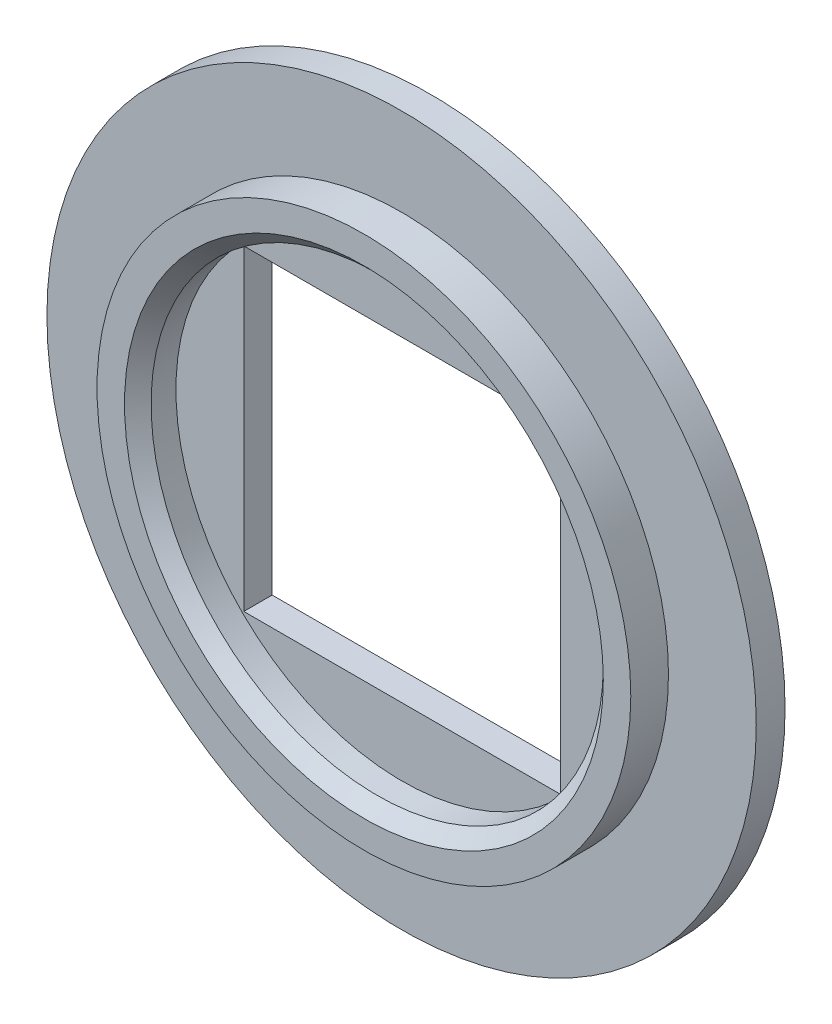
ISO-10303-21;
HEADER;
FILE_DESCRIPTION(('STEP AP214'),'2;1');
FILE_NAME('part.step','',(''),(''),'','','');
FILE_SCHEMA(('AUTOMOTIVE_DESIGN { 1 0 10303 214 1 1 1 1 }'));
ENDSEC;
DATA;
#1=APPLICATION_CONTEXT('core data for automotive mechanical design processes');
#2=APPLICATION_PROTOCOL_DEFINITION('international standard','automotive_design',2000,#1);
#3=PRODUCT_CONTEXT('',#1,'mechanical');
#4=PRODUCT('Part','Part','',(#3));
#5=PRODUCT_RELATED_PRODUCT_CATEGORY('part','',(#4));
#6=PRODUCT_DEFINITION_FORMATION('','',#4);
#7=PRODUCT_DEFINITION_CONTEXT('part definition',#1,'design');
#8=PRODUCT_DEFINITION('design','',#6,#7);
#9=PRODUCT_DEFINITION_SHAPE('','',#8);
#10=(LENGTH_UNIT() NAMED_UNIT(*) SI_UNIT(.MILLI.,.METRE.));
#11=(NAMED_UNIT(*) PLANE_ANGLE_UNIT() SI_UNIT($,.RADIAN.));
#12=(NAMED_UNIT(*) SI_UNIT($,.STERADIAN.) SOLID_ANGLE_UNIT());
#13=UNCERTAINTY_MEASURE_WITH_UNIT(LENGTH_MEASURE(1.E-05),#10,'distance_accuracy_value','');
#14=(GEOMETRIC_REPRESENTATION_CONTEXT(3) GLOBAL_UNCERTAINTY_ASSIGNED_CONTEXT((#13)) GLOBAL_UNIT_ASSIGNED_CONTEXT((#10,
#11,#12)) REPRESENTATION_CONTEXT('',''));
#15=CARTESIAN_POINT('',(0.,0.,0.));
#16=DIRECTION('',(0.,0.,1.));
#17=DIRECTION('',(1.,0.,0.));
#18=AXIS2_PLACEMENT_3D('',#15,#16,#17);
#19=CARTESIAN_POINT('',(0.,0.,0.));
#20=DIRECTION('',(0.,0.,1.));
#21=DIRECTION('',(1.,0.,0.));
#22=AXIS2_PLACEMENT_3D('',#19,#20,#21);
#23=PLANE('',#22);
#24=CARTESIAN_POINT('',(0.,0.,0.));
#25=DIRECTION('',(0.,0.,1.));
#26=DIRECTION('',(1.,0.,0.));
#27=AXIS2_PLACEMENT_3D('',#24,#25,#26);
#28=CIRCLE('',#27,8.);
#29=CARTESIAN_POINT('',(8.,0.,0.));
#30=VERTEX_POINT('',#29);
#31=EDGE_CURVE('E122',#30,#30,#28,.T.);
#32=ORIENTED_EDGE('',*,*,#31,.F.);
#33=EDGE_LOOP('',(#32));
#34=FACE_BOUND('',#33,.T.);
#35=DIRECTION('',(1.,0.,0.));
#36=VECTOR('',#35,1.);
#37=CARTESIAN_POINT('',(-3.57,-3.57,0.));
#38=LINE('',#37,#36);
#39=CARTESIAN_POINT('',(-3.57,-3.57,0.));
#40=VERTEX_POINT('',#39);
#41=CARTESIAN_POINT('',(3.57,-3.57,0.));
#42=VERTEX_POINT('',#41);
#43=EDGE_CURVE('E63',#40,#42,#38,.T.);
#44=ORIENTED_EDGE('',*,*,#43,.T.);
#45=DIRECTION('',(0.,1.,0.));
#46=VECTOR('',#45,1.);
#47=CARTESIAN_POINT('',(3.57,3.57,0.));
#48=LINE('',#47,#46);
#49=CARTESIAN_POINT('',(3.57,3.57,0.));
#50=VERTEX_POINT('',#49);
#51=EDGE_CURVE('E114',#42,#50,#48,.T.);
#52=ORIENTED_EDGE('',*,*,#51,.T.);
#53=DIRECTION('',(-1.,0.,0.));
#54=VECTOR('',#53,1.);
#55=CARTESIAN_POINT('',(-3.57,3.57,0.));
#56=LINE('',#55,#54);
#57=CARTESIAN_POINT('',(-3.57,3.57,0.));
#58=VERTEX_POINT('',#57);
#59=EDGE_CURVE('E92',#50,#58,#56,.T.);
#60=ORIENTED_EDGE('',*,*,#59,.T.);
#61=DIRECTION('',(0.,-1.,0.));
#62=VECTOR('',#61,1.);
#63=CARTESIAN_POINT('',(-3.57,0.,0.));
#64=LINE('',#63,#62);
#65=EDGE_CURVE('E88',#58,#40,#64,.T.);
#66=ORIENTED_EDGE('',*,*,#65,.T.);
#67=EDGE_LOOP('',(#44,#52,#60,#66));
#68=FACE_BOUND('',#67,.T.);
#69=ADVANCED_FACE('F39',(#34,#68),#23,.F.);
#70=CARTESIAN_POINT('',(0.,0.,0.65));
#71=DIRECTION('',(0.,0.,-1.));
#72=DIRECTION('',(-1.,0.,0.));
#73=AXIS2_PLACEMENT_3D('',#70,#71,#72);
#74=CYLINDRICAL_SURFACE('',#73,8.);
#75=CARTESIAN_POINT('',(0.,0.,0.65));
#76=DIRECTION('',(0.,0.,1.));
#77=DIRECTION('',(1.,0.,0.));
#78=AXIS2_PLACEMENT_3D('',#75,#76,#77);
#79=CIRCLE('',#78,8.);
#80=CARTESIAN_POINT('',(8.,0.,0.65));
#81=VERTEX_POINT('',#80);
#82=EDGE_CURVE('E125',#81,#81,#79,.T.);
#83=ORIENTED_EDGE('',*,*,#82,.F.);
#84=EDGE_LOOP('',(#83));
#85=FACE_BOUND('',#84,.T.);
#86=ORIENTED_EDGE('',*,*,#31,.T.);
#87=EDGE_LOOP('',(#86));
#88=FACE_BOUND('',#87,.T.);
#89=ADVANCED_FACE('F143',(#85,#88),#74,.T.);
#90=CARTESIAN_POINT('',(0.,0.,0.65));
#91=DIRECTION('',(0.,0.,1.));
#92=DIRECTION('',(1.,0.,0.));
#93=AXIS2_PLACEMENT_3D('',#90,#91,#92);
#94=PLANE('',#93);
#95=CARTESIAN_POINT('',(0.,0.,0.65));
#96=DIRECTION('',(0.,0.,1.));
#97=DIRECTION('',(1.,0.,0.));
#98=AXIS2_PLACEMENT_3D('',#95,#96,#97);
#99=CIRCLE('',#98,6.02);
#100=CARTESIAN_POINT('',(6.02,0.,0.65));
#101=VERTEX_POINT('',#100);
#102=EDGE_CURVE('E118',#101,#101,#99,.T.);
#103=ORIENTED_EDGE('',*,*,#102,.F.);
#104=EDGE_LOOP('',(#103));
#105=FACE_BOUND('',#104,.T.);
#106=ORIENTED_EDGE('',*,*,#82,.T.);
#107=EDGE_LOOP('',(#106));
#108=FACE_BOUND('',#107,.T.);
#109=ADVANCED_FACE('F149',(#105,#108),#94,.T.);
#110=CARTESIAN_POINT('',(0.,0.,1.5));
#111=DIRECTION('',(0.,0.,1.));
#112=DIRECTION('',(1.,0.,0.));
#113=AXIS2_PLACEMENT_3D('',#110,#111,#112);
#114=PLANE('',#113);
#115=CARTESIAN_POINT('',(0.,0.,1.5));
#116=DIRECTION('',(0.,0.,1.));
#117=DIRECTION('',(1.,0.,0.));
#118=AXIS2_PLACEMENT_3D('',#115,#116,#117);
#119=CIRCLE('',#118,5.40000000000001);
#120=CARTESIAN_POINT('',(5.40000000000001,0.,1.5));
#121=VERTEX_POINT('',#120);
#122=EDGE_CURVE('E11',#121,#121,#119,.F.);
#123=ORIENTED_EDGE('',*,*,#122,.T.);
#124=EDGE_LOOP('',(#123));
#125=FACE_BOUND('',#124,.T.);
#126=CARTESIAN_POINT('',(0.,0.,1.5));
#127=DIRECTION('',(0.,0.,1.));
#128=DIRECTION('',(1.,0.,0.));
#129=AXIS2_PLACEMENT_3D('',#126,#127,#128);
#130=CIRCLE('',#129,6.02);
#131=CARTESIAN_POINT('',(6.02,0.,1.5));
#132=VERTEX_POINT('',#131);
#133=EDGE_CURVE('E119',#132,#132,#130,.T.);
#134=ORIENTED_EDGE('',*,*,#133,.T.);
#135=EDGE_LOOP('',(#134));
#136=FACE_BOUND('',#135,.T.);
#137=ADVANCED_FACE('F156',(#125,#136),#114,.T.);
#138=CARTESIAN_POINT('',(0.,0.,1.5));
#139=DIRECTION('',(0.,0.,-1.));
#140=DIRECTION('',(-1.,0.,0.));
#141=AXIS2_PLACEMENT_3D('',#138,#139,#140);
#142=CYLINDRICAL_SURFACE('',#141,6.02);
#143=ORIENTED_EDGE('',*,*,#133,.F.);
#144=EDGE_LOOP('',(#143));
#145=FACE_BOUND('',#144,.T.);
#146=ORIENTED_EDGE('',*,*,#102,.T.);
#147=EDGE_LOOP('',(#146));
#148=FACE_BOUND('',#147,.T.);
#149=ADVANCED_FACE('F158',(#145,#148),#142,.T.);
#150=CARTESIAN_POINT('',(0.,0.,1.5));
#151=DIRECTION('',(0.,0.,-1.));
#152=DIRECTION('',(-1.,0.,0.));
#153=AXIS2_PLACEMENT_3D('',#150,#151,#152);
#154=CYLINDRICAL_SURFACE('',#153,5.1);
#155=CARTESIAN_POINT('',(0.,0.,1.2));
#156=DIRECTION('',(0.,0.,1.));
#157=DIRECTION('',(1.,0.,0.));
#158=AXIS2_PLACEMENT_3D('',#155,#156,#157);
#159=CIRCLE('',#158,5.1);
#160=CARTESIAN_POINT('',(5.1,0.,1.2));
#161=VERTEX_POINT('',#160);
#162=EDGE_CURVE('E48',#161,#161,#159,.T.);
#163=ORIENTED_EDGE('',*,*,#162,.T.);
#164=EDGE_LOOP('',(#163));
#165=FACE_BOUND('',#164,.T.);
#166=CARTESIAN_POINT('',(0.,0.,0.64));
#167=DIRECTION('',(0.,0.,1.));
#168=DIRECTION('',(1.,0.,0.));
#169=AXIS2_PLACEMENT_3D('',#166,#167,#168);
#170=CIRCLE('',#169,5.1);
#171=CARTESIAN_POINT('',(5.1,0.,0.64));
#172=VERTEX_POINT('',#171);
#173=EDGE_CURVE('E99',#172,#172,#170,.T.);
#174=ORIENTED_EDGE('',*,*,#173,.F.);
#175=EDGE_LOOP('',(#174));
#176=FACE_BOUND('',#175,.T.);
#177=ADVANCED_FACE('F132',(#165,#176),#154,.F.);
#178=CARTESIAN_POINT('',(0.,0.,0.64));
#179=DIRECTION('',(0.,0.,1.));
#180=DIRECTION('',(1.,0.,0.));
#181=AXIS2_PLACEMENT_3D('',#178,#179,#180);
#182=PLANE('',#181);
#183=DIRECTION('',(0.,-1.,0.));
#184=VECTOR('',#183,1.);
#185=CARTESIAN_POINT('',(-3.57,0.,0.64));
#186=LINE('',#185,#184);
#187=CARTESIAN_POINT('',(-3.57,3.57,0.64));
#188=VERTEX_POINT('',#187);
#189=CARTESIAN_POINT('',(-3.57,-3.57,0.64));
#190=VERTEX_POINT('',#189);
#191=EDGE_CURVE('E85',#188,#190,#186,.T.);
#192=ORIENTED_EDGE('',*,*,#191,.F.);
#193=DIRECTION('',(-1.,0.,0.));
#194=VECTOR('',#193,1.);
#195=CARTESIAN_POINT('',(-3.57,3.57,0.64));
#196=LINE('',#195,#194);
#197=CARTESIAN_POINT('',(3.57,3.57,0.64));
#198=VERTEX_POINT('',#197);
#199=EDGE_CURVE('E95',#198,#188,#196,.T.);
#200=ORIENTED_EDGE('',*,*,#199,.F.);
#201=DIRECTION('',(0.,1.,0.));
#202=VECTOR('',#201,1.);
#203=CARTESIAN_POINT('',(3.57,3.57,0.64));
#204=LINE('',#203,#202);
#205=CARTESIAN_POINT('',(3.57,-3.57,0.64));
#206=VERTEX_POINT('',#205);
#207=EDGE_CURVE('E55',#206,#198,#204,.T.);
#208=ORIENTED_EDGE('',*,*,#207,.F.);
#209=DIRECTION('',(1.,0.,0.));
#210=VECTOR('',#209,1.);
#211=CARTESIAN_POINT('',(-3.57,-3.57,0.64));
#212=LINE('',#211,#210);
#213=EDGE_CURVE('E104',#190,#206,#212,.T.);
#214=ORIENTED_EDGE('',*,*,#213,.F.);
#215=EDGE_LOOP('',(#192,#200,#208,#214));
#216=FACE_BOUND('',#215,.T.);
#217=ORIENTED_EDGE('',*,*,#173,.T.);
#218=EDGE_LOOP('',(#217));
#219=FACE_BOUND('',#218,.T.);
#220=ADVANCED_FACE('F101',(#216,#219),#182,.T.);
#221=CARTESIAN_POINT('',(-3.57,-3.57,10.7374848353439));
#222=DIRECTION('',(0.,1.,0.));
#223=DIRECTION('',(0.,0.,1.));
#224=AXIS2_PLACEMENT_3D('',#221,#222,#223);
#225=PLANE('',#224);
#226=ORIENTED_EDGE('',*,*,#213,.T.);
#227=DIRECTION('',(0.,0.,-1.));
#228=VECTOR('',#227,1.);
#229=CARTESIAN_POINT('',(3.57,-3.57,10.7374848353439));
#230=LINE('',#229,#228);
#231=EDGE_CURVE('E112',#206,#42,#230,.T.);
#232=ORIENTED_EDGE('',*,*,#231,.T.);
#233=ORIENTED_EDGE('',*,*,#43,.F.);
#234=DIRECTION('',(0.,0.,-1.));
#235=VECTOR('',#234,1.);
#236=CARTESIAN_POINT('',(-3.57,-3.57,10.7374848353439));
#237=LINE('',#236,#235);
#238=EDGE_CURVE('E110',#190,#40,#237,.T.);
#239=ORIENTED_EDGE('',*,*,#238,.F.);
#240=EDGE_LOOP('',(#226,#232,#233,#239));
#241=FACE_BOUND('',#240,.T.);
#242=ADVANCED_FACE('F169',(#241),#225,.T.);
#243=CARTESIAN_POINT('',(3.57,3.57,10.7374848353439));
#244=DIRECTION('',(-1.,0.,0.));
#245=DIRECTION('',(0.,0.,1.));
#246=AXIS2_PLACEMENT_3D('',#243,#244,#245);
#247=PLANE('',#246);
#248=ORIENTED_EDGE('',*,*,#207,.T.);
#249=DIRECTION('',(0.,0.,-1.));
#250=VECTOR('',#249,1.);
#251=CARTESIAN_POINT('',(3.57,3.57,10.7374848353439));
#252=LINE('',#251,#250);
#253=EDGE_CURVE('E97',#198,#50,#252,.T.);
#254=ORIENTED_EDGE('',*,*,#253,.T.);
#255=ORIENTED_EDGE('',*,*,#51,.F.);
#256=ORIENTED_EDGE('',*,*,#231,.F.);
#257=EDGE_LOOP('',(#248,#254,#255,#256));
#258=FACE_BOUND('',#257,.T.);
#259=ADVANCED_FACE('F172',(#258),#247,.T.);
#260=CARTESIAN_POINT('',(-3.57,3.57,10.7374848353439));
#261=DIRECTION('',(0.,-1.,0.));
#262=DIRECTION('',(0.,0.,-1.));
#263=AXIS2_PLACEMENT_3D('',#260,#261,#262);
#264=PLANE('',#263);
#265=ORIENTED_EDGE('',*,*,#199,.T.);
#266=DIRECTION('',(0.,0.,-1.));
#267=VECTOR('',#266,1.);
#268=CARTESIAN_POINT('',(-3.57,3.57,10.7374848353439));
#269=LINE('',#268,#267);
#270=EDGE_CURVE('E81',#188,#58,#269,.T.);
#271=ORIENTED_EDGE('',*,*,#270,.T.);
#272=ORIENTED_EDGE('',*,*,#59,.F.);
#273=ORIENTED_EDGE('',*,*,#253,.F.);
#274=EDGE_LOOP('',(#265,#271,#272,#273));
#275=FACE_BOUND('',#274,.T.);
#276=ADVANCED_FACE('F96',(#275),#264,.T.);
#277=CARTESIAN_POINT('',(-3.57,0.,10.7374848353439));
#278=DIRECTION('',(1.,0.,0.));
#279=DIRECTION('',(0.,0.,-1.));
#280=AXIS2_PLACEMENT_3D('',#277,#278,#279);
#281=PLANE('',#280);
#282=ORIENTED_EDGE('',*,*,#191,.T.);
#283=ORIENTED_EDGE('',*,*,#238,.T.);
#284=ORIENTED_EDGE('',*,*,#65,.F.);
#285=ORIENTED_EDGE('',*,*,#270,.F.);
#286=EDGE_LOOP('',(#282,#283,#284,#285));
#287=FACE_BOUND('',#286,.T.);
#288=ADVANCED_FACE('F83',(#287),#281,.T.);
#289=CARTESIAN_POINT('',(0.,0.,1.2));
#290=DIRECTION('',(0.,0.,1.));
#291=DIRECTION('',(1.,0.,0.));
#292=AXIS2_PLACEMENT_3D('',#289,#290,#291);
#293=CONICAL_SURFACE('',#292,5.1,0.785398163397457);
#294=ORIENTED_EDGE('',*,*,#122,.F.);
#295=EDGE_LOOP('',(#294));
#296=FACE_BOUND('',#295,.T.);
#297=ORIENTED_EDGE('',*,*,#162,.F.);
#298=EDGE_LOOP('',(#297));
#299=FACE_BOUND('',#298,.T.);
#300=ADVANCED_FACE('F42',(#296,#299),#293,.F.);
#301=CLOSED_SHELL('',(#69,#89,#109,#137,#149,#177,#220,#242,#259,#276,#288,#300));
#302=MANIFOLD_SOLID_BREP('B2',#301);
#303=ADVANCED_BREP_SHAPE_REPRESENTATION('',(#18,#302),#14);
#304=SHAPE_DEFINITION_REPRESENTATION(#9,#303);
ENDSEC;
END-ISO-10303-21;
